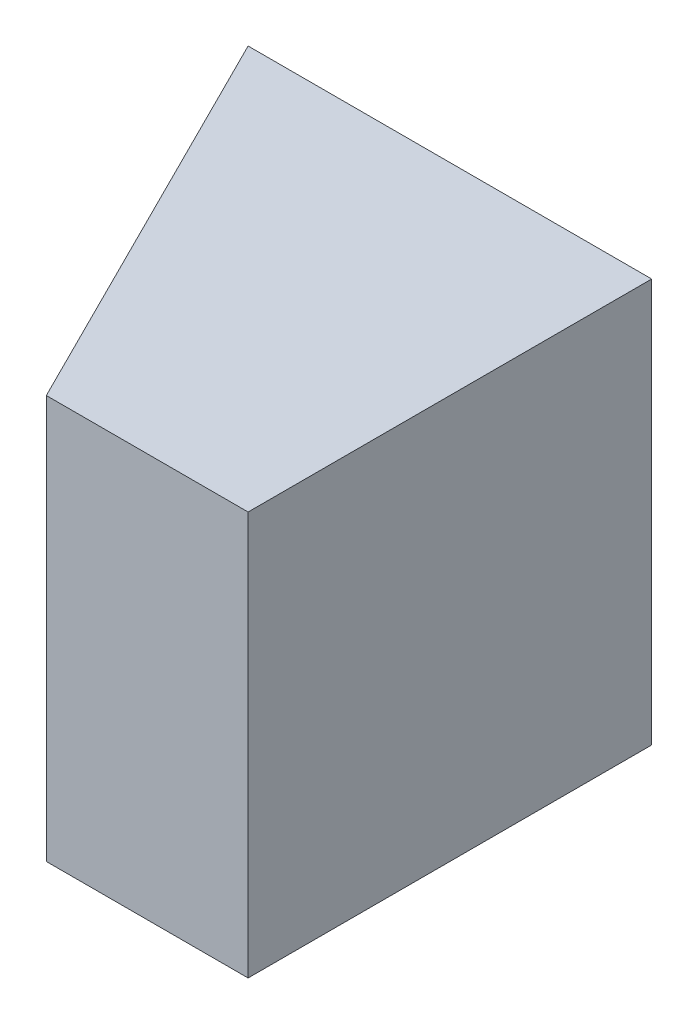
ISO-10303-21;
HEADER;
FILE_DESCRIPTION(('STEP AP214'),'2;1');
FILE_NAME('part.step','',(''),(''),'','','');
FILE_SCHEMA(('AUTOMOTIVE_DESIGN { 1 0 10303 214 1 1 1 1 }'));
ENDSEC;
DATA;
#1=APPLICATION_CONTEXT('core data for automotive mechanical design processes');
#2=APPLICATION_PROTOCOL_DEFINITION('international standard','automotive_design',2000,#1);
#3=PRODUCT_CONTEXT('',#1,'mechanical');
#4=PRODUCT('Part','Part','',(#3));
#5=PRODUCT_RELATED_PRODUCT_CATEGORY('part','',(#4));
#6=PRODUCT_DEFINITION_FORMATION('','',#4);
#7=PRODUCT_DEFINITION_CONTEXT('part definition',#1,'design');
#8=PRODUCT_DEFINITION('design','',#6,#7);
#9=PRODUCT_DEFINITION_SHAPE('','',#8);
#10=(LENGTH_UNIT() NAMED_UNIT(*) SI_UNIT(.MILLI.,.METRE.));
#11=(NAMED_UNIT(*) PLANE_ANGLE_UNIT() SI_UNIT($,.RADIAN.));
#12=(NAMED_UNIT(*) SI_UNIT($,.STERADIAN.) SOLID_ANGLE_UNIT());
#13=UNCERTAINTY_MEASURE_WITH_UNIT(LENGTH_MEASURE(1.E-05),#10,'distance_accuracy_value','');
#14=(GEOMETRIC_REPRESENTATION_CONTEXT(3) GLOBAL_UNCERTAINTY_ASSIGNED_CONTEXT((#13)) GLOBAL_UNIT_ASSIGNED_CONTEXT((#10,
#11,#12)) REPRESENTATION_CONTEXT('',''));
#15=CARTESIAN_POINT('',(0.,0.,0.));
#16=DIRECTION('',(0.,0.,1.));
#17=DIRECTION('',(1.,0.,0.));
#18=AXIS2_PLACEMENT_3D('',#15,#16,#17);
#19=CARTESIAN_POINT('',(0.,0.,20.));
#20=DIRECTION('',(0.,1.,0.));
#21=DIRECTION('',(0.,0.,1.));
#22=AXIS2_PLACEMENT_3D('',#19,#20,#21);
#23=PLANE('',#22);
#24=DIRECTION('',(1.,0.,0.));
#25=VECTOR('',#24,1.);
#26=CARTESIAN_POINT('',(0.,0.,20.));
#27=LINE('',#26,#25);
#28=CARTESIAN_POINT('',(9.99999999999999,0.,20.));
#29=VERTEX_POINT('',#28);
#30=CARTESIAN_POINT('',(20.,0.,20.));
#31=VERTEX_POINT('',#30);
#32=EDGE_CURVE('E86',#29,#31,#27,.T.);
#33=ORIENTED_EDGE('',*,*,#32,.F.);
#34=DIRECTION('',(-0.447213595499958,0.,-0.894427190999916));
#35=VECTOR('',#34,1.);
#36=CARTESIAN_POINT('',(0.,0.,0.));
#37=LINE('',#36,#35);
#38=CARTESIAN_POINT('',(0.,0.,0.));
#39=VERTEX_POINT('',#38);
#40=EDGE_CURVE('E80',#29,#39,#37,.T.);
#41=ORIENTED_EDGE('',*,*,#40,.T.);
#42=DIRECTION('',(1.,0.,0.));
#43=VECTOR('',#42,1.);
#44=CARTESIAN_POINT('',(0.,0.,0.));
#45=LINE('',#44,#43);
#46=CARTESIAN_POINT('',(20.,0.,0.));
#47=VERTEX_POINT('',#46);
#48=EDGE_CURVE('E90',#39,#47,#45,.T.);
#49=ORIENTED_EDGE('',*,*,#48,.T.);
#50=DIRECTION('',(0.,0.,-1.));
#51=VECTOR('',#50,1.);
#52=CARTESIAN_POINT('',(20.,0.,20.));
#53=LINE('',#52,#51);
#54=EDGE_CURVE('E11',#31,#47,#53,.T.);
#55=ORIENTED_EDGE('',*,*,#54,.F.);
#56=EDGE_LOOP('',(#33,#41,#49,#55));
#57=FACE_BOUND('',#56,.T.);
#58=ADVANCED_FACE('F33',(#57),#23,.F.);
#59=CARTESIAN_POINT('',(20.,0.,20.));
#60=DIRECTION('',(-1.,0.,0.));
#61=DIRECTION('',(0.,-1.,0.));
#62=AXIS2_PLACEMENT_3D('',#59,#60,#61);
#63=PLANE('',#62);
#64=DIRECTION('',(0.,1.,0.));
#65=VECTOR('',#64,1.);
#66=CARTESIAN_POINT('',(20.,0.,0.));
#67=LINE('',#66,#65);
#68=CARTESIAN_POINT('',(20.,20.,0.));
#69=VERTEX_POINT('',#68);
#70=EDGE_CURVE('E61',#47,#69,#67,.T.);
#71=ORIENTED_EDGE('',*,*,#70,.T.);
#72=DIRECTION('',(0.,0.,-1.));
#73=VECTOR('',#72,1.);
#74=CARTESIAN_POINT('',(20.,20.,20.));
#75=LINE('',#74,#73);
#76=CARTESIAN_POINT('',(20.,20.,20.));
#77=VERTEX_POINT('',#76);
#78=EDGE_CURVE('E41',#77,#69,#75,.T.);
#79=ORIENTED_EDGE('',*,*,#78,.F.);
#80=DIRECTION('',(0.,1.,0.));
#81=VECTOR('',#80,1.);
#82=CARTESIAN_POINT('',(20.,0.,20.));
#83=LINE('',#82,#81);
#84=EDGE_CURVE('E49',#31,#77,#83,.T.);
#85=ORIENTED_EDGE('',*,*,#84,.F.);
#86=ORIENTED_EDGE('',*,*,#54,.T.);
#87=EDGE_LOOP('',(#71,#79,#85,#86));
#88=FACE_BOUND('',#87,.T.);
#89=ADVANCED_FACE('F107',(#88),#63,.F.);
#90=CARTESIAN_POINT('',(0.,20.,20.));
#91=DIRECTION('',(0.,-1.,0.));
#92=DIRECTION('',(0.,0.,-1.));
#93=AXIS2_PLACEMENT_3D('',#90,#91,#92);
#94=PLANE('',#93);
#95=DIRECTION('',(-1.,0.,0.));
#96=VECTOR('',#95,1.);
#97=CARTESIAN_POINT('',(0.,20.,0.));
#98=LINE('',#97,#96);
#99=CARTESIAN_POINT('',(0.,20.,0.));
#100=VERTEX_POINT('',#99);
#101=EDGE_CURVE('E83',#69,#100,#98,.T.);
#102=ORIENTED_EDGE('',*,*,#101,.T.);
#103=DIRECTION('',(-0.447213595499958,0.,-0.894427190999916));
#104=VECTOR('',#103,1.);
#105=CARTESIAN_POINT('',(0.,20.,0.));
#106=LINE('',#105,#104);
#107=CARTESIAN_POINT('',(9.99999999999999,20.,20.));
#108=VERTEX_POINT('',#107);
#109=EDGE_CURVE('E68',#108,#100,#106,.T.);
#110=ORIENTED_EDGE('',*,*,#109,.F.);
#111=DIRECTION('',(-1.,0.,0.));
#112=VECTOR('',#111,1.);
#113=CARTESIAN_POINT('',(0.,20.,20.));
#114=LINE('',#113,#112);
#115=EDGE_CURVE('E95',#77,#108,#114,.T.);
#116=ORIENTED_EDGE('',*,*,#115,.F.);
#117=ORIENTED_EDGE('',*,*,#78,.T.);
#118=EDGE_LOOP('',(#102,#110,#116,#117));
#119=FACE_BOUND('',#118,.T.);
#120=ADVANCED_FACE('F84',(#119),#94,.F.);
#121=CARTESIAN_POINT('',(0.,0.,20.));
#122=DIRECTION('',(0.,0.,-1.));
#123=DIRECTION('',(-1.,0.,0.));
#124=AXIS2_PLACEMENT_3D('',#121,#122,#123);
#125=PLANE('',#124);
#126=ORIENTED_EDGE('',*,*,#115,.T.);
#127=DIRECTION('',(0.,1.,0.));
#128=VECTOR('',#127,1.);
#129=CARTESIAN_POINT('',(9.99999999999999,0.,20.));
#130=LINE('',#129,#128);
#131=EDGE_CURVE('E77',#29,#108,#130,.T.);
#132=ORIENTED_EDGE('',*,*,#131,.F.);
#133=ORIENTED_EDGE('',*,*,#32,.T.);
#134=ORIENTED_EDGE('',*,*,#84,.T.);
#135=EDGE_LOOP('',(#126,#132,#133,#134));
#136=FACE_BOUND('',#135,.T.);
#137=ADVANCED_FACE('F106',(#136),#125,.F.);
#138=CARTESIAN_POINT('',(0.,0.,0.));
#139=DIRECTION('',(0.,0.,-1.));
#140=DIRECTION('',(-1.,0.,0.));
#141=AXIS2_PLACEMENT_3D('',#138,#139,#140);
#142=PLANE('',#141);
#143=DIRECTION('',(0.,-1.,0.));
#144=VECTOR('',#143,1.);
#145=CARTESIAN_POINT('',(0.,0.,0.));
#146=LINE('',#145,#144);
#147=EDGE_CURVE('E73',#100,#39,#146,.T.);
#148=ORIENTED_EDGE('',*,*,#147,.F.);
#149=ORIENTED_EDGE('',*,*,#101,.F.);
#150=ORIENTED_EDGE('',*,*,#70,.F.);
#151=ORIENTED_EDGE('',*,*,#48,.F.);
#152=EDGE_LOOP('',(#148,#149,#150,#151));
#153=FACE_BOUND('',#152,.T.);
#154=ADVANCED_FACE('F89',(#153),#142,.T.);
#155=CARTESIAN_POINT('',(0.,0.,0.));
#156=DIRECTION('',(0.894427190999916,0.,-0.447213595499958));
#157=DIRECTION('',(-0.447213595499958,0.,-0.894427190999916));
#158=AXIS2_PLACEMENT_3D('',#155,#156,#157);
#159=PLANE('',#158);
#160=ORIENTED_EDGE('',*,*,#109,.T.);
#161=ORIENTED_EDGE('',*,*,#147,.T.);
#162=ORIENTED_EDGE('',*,*,#40,.F.);
#163=ORIENTED_EDGE('',*,*,#131,.T.);
#164=EDGE_LOOP('',(#160,#161,#162,#163));
#165=FACE_BOUND('',#164,.T.);
#166=ADVANCED_FACE('F70',(#165),#159,.F.);
#167=CLOSED_SHELL('',(#58,#89,#120,#137,#154,#166));
#168=MANIFOLD_SOLID_BREP('B2',#167);
#169=ADVANCED_BREP_SHAPE_REPRESENTATION('',(#18,#168),#14);
#170=SHAPE_DEFINITION_REPRESENTATION(#9,#169);
ENDSEC;
END-ISO-10303-21;
